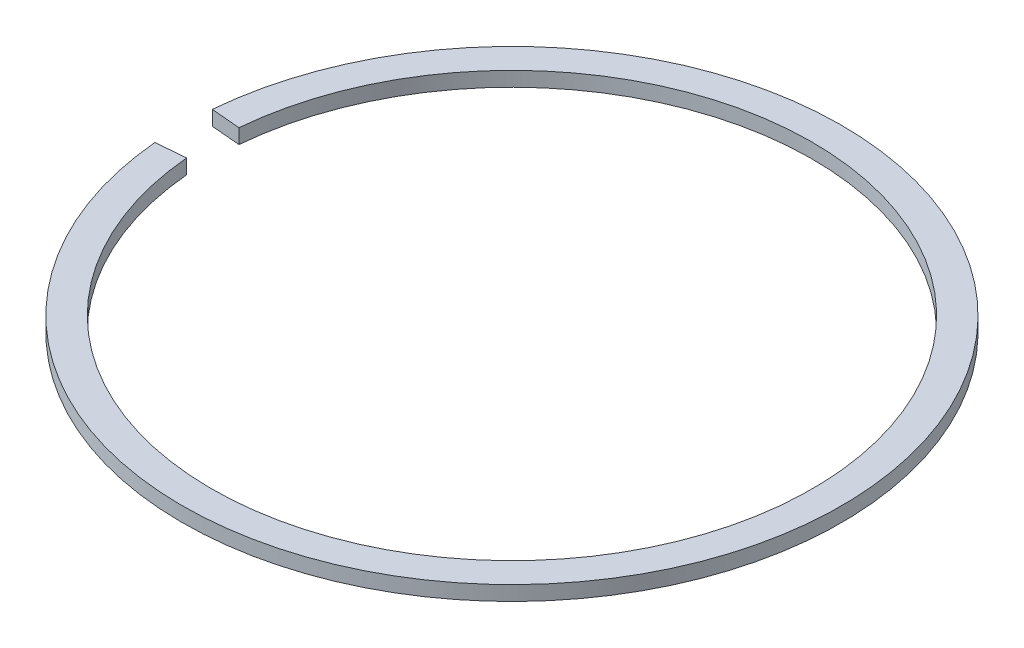
ISO-10303-21;
HEADER;
FILE_DESCRIPTION(('STEP AP214'),'2;1');
FILE_NAME('part.step','',(''),(''),'','','');
FILE_SCHEMA(('AUTOMOTIVE_DESIGN { 1 0 10303 214 1 1 1 1 }'));
ENDSEC;
DATA;
#1=APPLICATION_CONTEXT('core data for automotive mechanical design processes');
#2=APPLICATION_PROTOCOL_DEFINITION('international standard','automotive_design',2000,#1);
#3=PRODUCT_CONTEXT('',#1,'mechanical');
#4=PRODUCT('Part','Part','',(#3));
#5=PRODUCT_RELATED_PRODUCT_CATEGORY('part','',(#4));
#6=PRODUCT_DEFINITION_FORMATION('','',#4);
#7=PRODUCT_DEFINITION_CONTEXT('part definition',#1,'design');
#8=PRODUCT_DEFINITION('design','',#6,#7);
#9=PRODUCT_DEFINITION_SHAPE('','',#8);
#10=(LENGTH_UNIT() NAMED_UNIT(*) SI_UNIT(.MILLI.,.METRE.));
#11=(NAMED_UNIT(*) PLANE_ANGLE_UNIT() SI_UNIT($,.RADIAN.));
#12=(NAMED_UNIT(*) SI_UNIT($,.STERADIAN.) SOLID_ANGLE_UNIT());
#13=UNCERTAINTY_MEASURE_WITH_UNIT(LENGTH_MEASURE(1.E-05),#10,'distance_accuracy_value','');
#14=(GEOMETRIC_REPRESENTATION_CONTEXT(3) GLOBAL_UNCERTAINTY_ASSIGNED_CONTEXT((#13)) GLOBAL_UNIT_ASSIGNED_CONTEXT((#10,
#11,#12)) REPRESENTATION_CONTEXT('',''));
#15=CARTESIAN_POINT('',(0.,0.,0.));
#16=DIRECTION('',(0.,0.,1.));
#17=DIRECTION('',(1.,0.,0.));
#18=AXIS2_PLACEMENT_3D('',#15,#16,#17);
#19=CARTESIAN_POINT('',(0.,0.,0.));
#20=DIRECTION('',(0.,-1.,0.));
#21=DIRECTION('',(0.,0.,-1.));
#22=AXIS2_PLACEMENT_3D('',#19,#20,#21);
#23=CYLINDRICAL_SURFACE('',#22,41.);
#24=CARTESIAN_POINT('',(0.,2.45360824742268,0.));
#25=DIRECTION('',(0.,-1.,0.));
#26=DIRECTION('',(0.,0.,-1.));
#27=AXIS2_PLACEMENT_3D('',#24,#25,#26);
#28=CIRCLE('',#27,41.);
#29=CARTESIAN_POINT('',(-40.8439826217616,2.45360824742268,-3.57338545265371));
#30=VERTEX_POINT('',#29);
#31=CARTESIAN_POINT('',(-40.8439826217616,2.45360824742268,3.57338545265371));
#32=VERTEX_POINT('',#31);
#33=EDGE_CURVE('E11',#30,#32,#28,.T.);
#34=ORIENTED_EDGE('',*,*,#33,.F.);
#35=DIRECTION('',(0.,-1.,0.));
#36=VECTOR('',#35,1.);
#37=CARTESIAN_POINT('',(-40.8439826217616,0.453608247422685,-3.57338545265371));
#38=LINE('',#37,#36);
#39=CARTESIAN_POINT('',(-40.8439826217616,0.453608247422685,-3.57338545265371));
#40=VERTEX_POINT('',#39);
#41=EDGE_CURVE('E85',#30,#40,#38,.T.);
#42=ORIENTED_EDGE('',*,*,#41,.T.);
#43=CARTESIAN_POINT('',(0.,0.453608247422685,0.));
#44=DIRECTION('',(0.,-1.,0.));
#45=DIRECTION('',(0.,0.,-1.));
#46=AXIS2_PLACEMENT_3D('',#43,#44,#45);
#47=CIRCLE('',#46,41.);
#48=CARTESIAN_POINT('',(-40.8439826217616,0.453608247422685,3.57338545265371));
#49=VERTEX_POINT('',#48);
#50=EDGE_CURVE('E80',#40,#49,#47,.T.);
#51=ORIENTED_EDGE('',*,*,#50,.T.);
#52=DIRECTION('',(0.,-1.,0.));
#53=VECTOR('',#52,1.);
#54=CARTESIAN_POINT('',(-40.8439826217616,0.453608247422685,3.57338545265371));
#55=LINE('',#54,#53);
#56=EDGE_CURVE('E83',#32,#49,#55,.T.);
#57=ORIENTED_EDGE('',*,*,#56,.F.);
#58=EDGE_LOOP('',(#34,#42,#51,#57));
#59=FACE_BOUND('',#58,.T.);
#60=ADVANCED_FACE('F44',(#59),#23,.F.);
#61=CARTESIAN_POINT('',(-40.8439826217616,2.45360824742268,-3.57338545265371));
#62=DIRECTION('',(0.,1.,0.));
#63=DIRECTION('',(0.,0.,1.));
#64=AXIS2_PLACEMENT_3D('',#61,#62,#63);
#65=PLANE('',#64);
#66=CARTESIAN_POINT('',(0.,2.45360824742268,0.));
#67=DIRECTION('',(0.,-1.,0.));
#68=DIRECTION('',(0.,0.,-1.));
#69=AXIS2_PLACEMENT_3D('',#66,#67,#68);
#70=CIRCLE('',#69,45.);
#71=CARTESIAN_POINT('',(-44.8287614141286,2.45360824742268,-3.92200842364432));
#72=VERTEX_POINT('',#71);
#73=CARTESIAN_POINT('',(-44.8287614141286,2.45360824742268,3.92200842364432));
#74=VERTEX_POINT('',#73);
#75=EDGE_CURVE('E52',#72,#74,#70,.T.);
#76=ORIENTED_EDGE('',*,*,#75,.F.);
#77=DIRECTION('',(0.996194698091746,0.,0.0871557427476515));
#78=VECTOR('',#77,1.);
#79=CARTESIAN_POINT('',(-40.8439826217616,2.45360824742268,-3.57338545265371));
#80=LINE('',#79,#78);
#81=EDGE_CURVE('E90',#72,#30,#80,.T.);
#82=ORIENTED_EDGE('',*,*,#81,.T.);
#83=ORIENTED_EDGE('',*,*,#33,.T.);
#84=DIRECTION('',(0.996194698091746,0.,-0.0871557427476516));
#85=VECTOR('',#84,1.);
#86=CARTESIAN_POINT('',(-40.8439826217616,2.45360824742268,3.57338545265371));
#87=LINE('',#86,#85);
#88=EDGE_CURVE('E102',#74,#32,#87,.T.);
#89=ORIENTED_EDGE('',*,*,#88,.F.);
#90=EDGE_LOOP('',(#76,#82,#83,#89));
#91=FACE_BOUND('',#90,.T.);
#92=ADVANCED_FACE('F46',(#91),#65,.T.);
#93=CARTESIAN_POINT('',(0.,0.,0.));
#94=DIRECTION('',(0.,-1.,0.));
#95=DIRECTION('',(0.,0.,-1.));
#96=AXIS2_PLACEMENT_3D('',#93,#94,#95);
#97=CYLINDRICAL_SURFACE('',#96,45.);
#98=CARTESIAN_POINT('',(0.,0.453608247422685,0.));
#99=DIRECTION('',(0.,-1.,0.));
#100=DIRECTION('',(0.,0.,-1.));
#101=AXIS2_PLACEMENT_3D('',#98,#99,#100);
#102=CIRCLE('',#101,45.);
#103=CARTESIAN_POINT('',(-44.8287614141286,0.453608247422685,-3.92200842364432));
#104=VERTEX_POINT('',#103);
#105=CARTESIAN_POINT('',(-44.8287614141286,0.453608247422685,3.92200842364432));
#106=VERTEX_POINT('',#105);
#107=EDGE_CURVE('E89',#104,#106,#102,.T.);
#108=ORIENTED_EDGE('',*,*,#107,.F.);
#109=DIRECTION('',(0.,1.,0.));
#110=VECTOR('',#109,1.);
#111=CARTESIAN_POINT('',(-44.8287614141286,0.453608247422685,-3.92200842364432));
#112=LINE('',#111,#110);
#113=EDGE_CURVE('E110',#104,#72,#112,.T.);
#114=ORIENTED_EDGE('',*,*,#113,.T.);
#115=ORIENTED_EDGE('',*,*,#75,.T.);
#116=DIRECTION('',(0.,1.,0.));
#117=VECTOR('',#116,1.);
#118=CARTESIAN_POINT('',(-44.8287614141286,0.453608247422685,3.92200842364432));
#119=LINE('',#118,#117);
#120=EDGE_CURVE('E98',#106,#74,#119,.T.);
#121=ORIENTED_EDGE('',*,*,#120,.F.);
#122=EDGE_LOOP('',(#108,#114,#115,#121));
#123=FACE_BOUND('',#122,.T.);
#124=ADVANCED_FACE('F114',(#123),#97,.T.);
#125=CARTESIAN_POINT('',(-40.8439826217616,0.453608247422685,-3.57338545265371));
#126=DIRECTION('',(0.,-1.,0.));
#127=DIRECTION('',(0.,0.,-1.));
#128=AXIS2_PLACEMENT_3D('',#125,#126,#127);
#129=PLANE('',#128);
#130=DIRECTION('',(-0.996194698091746,0.,-0.0871557427476515));
#131=VECTOR('',#130,1.);
#132=CARTESIAN_POINT('',(-40.8439826217616,0.453608247422685,-3.57338545265371));
#133=LINE('',#132,#131);
#134=EDGE_CURVE('E108',#40,#104,#133,.T.);
#135=ORIENTED_EDGE('',*,*,#134,.T.);
#136=ORIENTED_EDGE('',*,*,#107,.T.);
#137=DIRECTION('',(-0.996194698091746,0.,0.0871557427476516));
#138=VECTOR('',#137,1.);
#139=CARTESIAN_POINT('',(-40.8439826217616,0.453608247422685,3.57338545265371));
#140=LINE('',#139,#138);
#141=EDGE_CURVE('E93',#49,#106,#140,.T.);
#142=ORIENTED_EDGE('',*,*,#141,.F.);
#143=ORIENTED_EDGE('',*,*,#50,.F.);
#144=EDGE_LOOP('',(#135,#136,#142,#143));
#145=FACE_BOUND('',#144,.T.);
#146=ADVANCED_FACE('F94',(#145),#129,.T.);
#147=CARTESIAN_POINT('',(0.,0.,0.));
#148=DIRECTION('',(-0.0871557427476515,0.,0.996194698091746));
#149=DIRECTION('',(0.996194698091746,0.,0.0871557427476515));
#150=AXIS2_PLACEMENT_3D('',#147,#148,#149);
#151=PLANE('',#150);
#152=ORIENTED_EDGE('',*,*,#41,.F.);
#153=ORIENTED_EDGE('',*,*,#81,.F.);
#154=ORIENTED_EDGE('',*,*,#113,.F.);
#155=ORIENTED_EDGE('',*,*,#134,.F.);
#156=EDGE_LOOP('',(#152,#153,#154,#155));
#157=FACE_BOUND('',#156,.T.);
#158=ADVANCED_FACE('F118',(#157),#151,.T.);
#159=CARTESIAN_POINT('',(0.,0.,0.));
#160=DIRECTION('',(0.0871557427476516,0.,0.996194698091746));
#161=DIRECTION('',(0.996194698091746,0.,-0.0871557427476516));
#162=AXIS2_PLACEMENT_3D('',#159,#160,#161);
#163=PLANE('',#162);
#164=ORIENTED_EDGE('',*,*,#56,.T.);
#165=ORIENTED_EDGE('',*,*,#141,.T.);
#166=ORIENTED_EDGE('',*,*,#120,.T.);
#167=ORIENTED_EDGE('',*,*,#88,.T.);
#168=EDGE_LOOP('',(#164,#165,#166,#167));
#169=FACE_BOUND('',#168,.T.);
#170=ADVANCED_FACE('F101',(#169),#163,.F.);
#171=CLOSED_SHELL('',(#60,#92,#124,#146,#158,#170));
#172=MANIFOLD_SOLID_BREP('B2',#171);
#173=ADVANCED_BREP_SHAPE_REPRESENTATION('',(#18,#172),#14);
#174=SHAPE_DEFINITION_REPRESENTATION(#9,#173);
ENDSEC;
END-ISO-10303-21;
